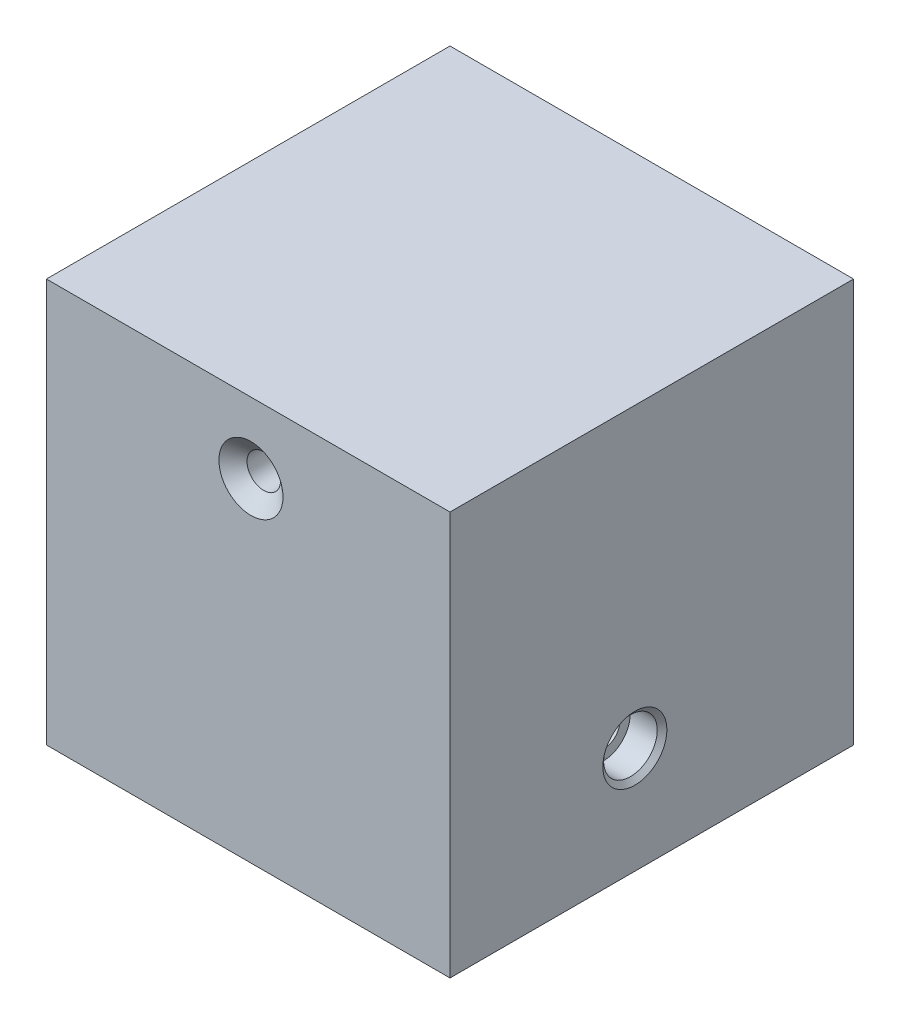
ISO-10303-21;
HEADER;
FILE_DESCRIPTION(('STEP AP214'),'2;1');
FILE_NAME('part.step','',(''),(''),'','','');
FILE_SCHEMA(('AUTOMOTIVE_DESIGN { 1 0 10303 214 1 1 1 1 }'));
ENDSEC;
DATA;
#1=APPLICATION_CONTEXT('core data for automotive mechanical design processes');
#2=APPLICATION_PROTOCOL_DEFINITION('international standard','automotive_design',2000,#1);
#3=PRODUCT_CONTEXT('',#1,'mechanical');
#4=PRODUCT('Part','Part','',(#3));
#5=PRODUCT_RELATED_PRODUCT_CATEGORY('part','',(#4));
#6=PRODUCT_DEFINITION_FORMATION('','',#4);
#7=PRODUCT_DEFINITION_CONTEXT('part definition',#1,'design');
#8=PRODUCT_DEFINITION('design','',#6,#7);
#9=PRODUCT_DEFINITION_SHAPE('','',#8);
#10=(LENGTH_UNIT() NAMED_UNIT(*) SI_UNIT(.MILLI.,.METRE.));
#11=(NAMED_UNIT(*) PLANE_ANGLE_UNIT() SI_UNIT($,.RADIAN.));
#12=(NAMED_UNIT(*) SI_UNIT($,.STERADIAN.) SOLID_ANGLE_UNIT());
#13=UNCERTAINTY_MEASURE_WITH_UNIT(LENGTH_MEASURE(1.E-05),#10,'distance_accuracy_value','');
#14=(GEOMETRIC_REPRESENTATION_CONTEXT(3) GLOBAL_UNCERTAINTY_ASSIGNED_CONTEXT((#13)) GLOBAL_UNIT_ASSIGNED_CONTEXT((#10,
#11,#12)) REPRESENTATION_CONTEXT('',''));
#15=CARTESIAN_POINT('',(0.,0.,0.));
#16=DIRECTION('',(0.,0.,1.));
#17=DIRECTION('',(1.,0.,0.));
#18=AXIS2_PLACEMENT_3D('',#15,#16,#17);
#19=CARTESIAN_POINT('',(101.6,26.8232451806077,55.0625341901142));
#20=DIRECTION('',(1.,0.,0.));
#21=DIRECTION('',(0.,0.,-1.));
#22=AXIS2_PLACEMENT_3D('',#19,#20,#21);
#23=CYLINDRICAL_SURFACE('',#22,4.21639999999999);
#24=CARTESIAN_POINT('',(93.6625,26.8232451806077,55.0625341901142));
#25=DIRECTION('',(1.,0.,0.));
#26=DIRECTION('',(0.,0.,-1.));
#27=AXIS2_PLACEMENT_3D('',#24,#25,#26);
#28=CIRCLE('',#27,4.21640000000001);
#29=CARTESIAN_POINT('',(93.6625,26.8232451806077,50.8461341901142));
#30=VERTEX_POINT('',#29);
#31=EDGE_CURVE('E361',#30,#30,#28,.T.);
#32=ORIENTED_EDGE('',*,*,#31,.T.);
#33=EDGE_LOOP('',(#32));
#34=FACE_BOUND('',#33,.T.);
#35=CARTESIAN_POINT('',(12.7,26.8232451806077,55.0625341901142));
#36=DIRECTION('',(-1.,0.,0.));
#37=DIRECTION('',(0.,0.,1.));
#38=AXIS2_PLACEMENT_3D('',#35,#36,#37);
#39=CIRCLE('',#38,4.21639999999999);
#40=CARTESIAN_POINT('',(12.7,26.8232451806077,59.2789341901142));
#41=VERTEX_POINT('',#40);
#42=EDGE_CURVE('E137',#41,#41,#39,.F.);
#43=ORIENTED_EDGE('',*,*,#42,.F.);
#44=EDGE_LOOP('',(#43));
#45=FACE_BOUND('',#44,.T.);
#46=ADVANCED_FACE('F46',(#34,#45),#23,.F.);
#47=CARTESIAN_POINT('',(0.,0.,101.6));
#48=DIRECTION('',(1.,0.,0.));
#49=DIRECTION('',(0.,0.,-1.));
#50=AXIS2_PLACEMENT_3D('',#47,#48,#49);
#51=PLANE('',#50);
#52=CARTESIAN_POINT('',(0.,26.8232451806077,55.0625341901142));
#53=DIRECTION('',(1.,0.,0.));
#54=DIRECTION('',(0.,0.,-1.));
#55=AXIS2_PLACEMENT_3D('',#52,#53,#54);
#56=CIRCLE('',#55,9.46277456392465);
#57=CARTESIAN_POINT('',(0.,26.8232451806077,45.5997596261896));
#58=VERTEX_POINT('',#57);
#59=EDGE_CURVE('E12',#58,#58,#56,.T.);
#60=ORIENTED_EDGE('',*,*,#59,.T.);
#61=EDGE_LOOP('',(#60));
#62=FACE_BOUND('',#61,.T.);
#63=DIRECTION('',(0.,-1.,0.));
#64=VECTOR('',#63,1.);
#65=CARTESIAN_POINT('',(0.,0.,0.));
#66=LINE('',#65,#64);
#67=CARTESIAN_POINT('',(0.,101.6,0.));
#68=VERTEX_POINT('',#67);
#69=CARTESIAN_POINT('',(0.,0.,0.));
#70=VERTEX_POINT('',#69);
#71=EDGE_CURVE('E120',#68,#70,#66,.T.);
#72=ORIENTED_EDGE('',*,*,#71,.T.);
#73=DIRECTION('',(0.,0.,-1.));
#74=VECTOR('',#73,1.);
#75=CARTESIAN_POINT('',(0.,0.,101.6));
#76=LINE('',#75,#74);
#77=CARTESIAN_POINT('',(0.,0.,101.6));
#78=VERTEX_POINT('',#77);
#79=EDGE_CURVE('E109',#78,#70,#76,.T.);
#80=ORIENTED_EDGE('',*,*,#79,.F.);
#81=DIRECTION('',(0.,-1.,0.));
#82=VECTOR('',#81,1.);
#83=CARTESIAN_POINT('',(0.,0.,101.6));
#84=LINE('',#83,#82);
#85=CARTESIAN_POINT('',(0.,101.6,101.6));
#86=VERTEX_POINT('',#85);
#87=EDGE_CURVE('E101',#86,#78,#84,.T.);
#88=ORIENTED_EDGE('',*,*,#87,.F.);
#89=DIRECTION('',(0.,0.,-1.));
#90=VECTOR('',#89,1.);
#91=CARTESIAN_POINT('',(0.,101.6,101.6));
#92=LINE('',#91,#90);
#93=EDGE_CURVE('E116',#86,#68,#92,.T.);
#94=ORIENTED_EDGE('',*,*,#93,.T.);
#95=EDGE_LOOP('',(#72,#80,#88,#94));
#96=FACE_BOUND('',#95,.T.);
#97=ADVANCED_FACE('F158',(#62,#96),#51,.F.);
#98=CARTESIAN_POINT('',(0.,0.,101.6));
#99=DIRECTION('',(0.,1.,0.));
#100=DIRECTION('',(0.,0.,1.));
#101=AXIS2_PLACEMENT_3D('',#98,#99,#100);
#102=PLANE('',#101);
#103=DIRECTION('',(1.,0.,0.));
#104=VECTOR('',#103,1.);
#105=CARTESIAN_POINT('',(0.,0.,0.));
#106=LINE('',#105,#104);
#107=CARTESIAN_POINT('',(101.6,0.,0.));
#108=VERTEX_POINT('',#107);
#109=EDGE_CURVE('E107',#70,#108,#106,.T.);
#110=ORIENTED_EDGE('',*,*,#109,.T.);
#111=DIRECTION('',(0.,0.,-1.));
#112=VECTOR('',#111,1.);
#113=CARTESIAN_POINT('',(101.6,0.,101.6));
#114=LINE('',#113,#112);
#115=CARTESIAN_POINT('',(101.6,0.,101.6));
#116=VERTEX_POINT('',#115);
#117=EDGE_CURVE('E105',#116,#108,#114,.T.);
#118=ORIENTED_EDGE('',*,*,#117,.F.);
#119=DIRECTION('',(1.,0.,0.));
#120=VECTOR('',#119,1.);
#121=CARTESIAN_POINT('',(0.,0.,101.6));
#122=LINE('',#121,#120);
#123=EDGE_CURVE('E96',#78,#116,#122,.T.);
#124=ORIENTED_EDGE('',*,*,#123,.F.);
#125=ORIENTED_EDGE('',*,*,#79,.T.);
#126=EDGE_LOOP('',(#110,#118,#124,#125));
#127=FACE_BOUND('',#126,.T.);
#128=ADVANCED_FACE('F106',(#127),#102,.F.);
#129=CARTESIAN_POINT('',(101.6,0.,101.6));
#130=DIRECTION('',(-1.,0.,0.));
#131=DIRECTION('',(0.,0.,1.));
#132=AXIS2_PLACEMENT_3D('',#129,#130,#131);
#133=PLANE('',#132);
#134=CARTESIAN_POINT('',(101.6,26.8232451806077,55.0625341901142));
#135=DIRECTION('',(1.,0.,0.));
#136=DIRECTION('',(0.,0.,-1.));
#137=AXIS2_PLACEMENT_3D('',#134,#135,#136);
#138=CIRCLE('',#137,8.06450000000001);
#139=CARTESIAN_POINT('',(101.6,26.8232451806077,46.9980341901142));
#140=VERTEX_POINT('',#139);
#141=EDGE_CURVE('E140',#140,#140,#138,.T.);
#142=ORIENTED_EDGE('',*,*,#141,.F.);
#143=EDGE_LOOP('',(#142));
#144=FACE_BOUND('',#143,.T.);
#145=DIRECTION('',(0.,1.,0.));
#146=VECTOR('',#145,1.);
#147=CARTESIAN_POINT('',(101.6,0.,0.));
#148=LINE('',#147,#146);
#149=CARTESIAN_POINT('',(101.6,101.6,0.));
#150=VERTEX_POINT('',#149);
#151=EDGE_CURVE('E82',#108,#150,#148,.T.);
#152=ORIENTED_EDGE('',*,*,#151,.T.);
#153=DIRECTION('',(0.,0.,-1.));
#154=VECTOR('',#153,1.);
#155=CARTESIAN_POINT('',(101.6,101.6,101.6));
#156=LINE('',#155,#154);
#157=CARTESIAN_POINT('',(101.6,101.6,101.6));
#158=VERTEX_POINT('',#157);
#159=EDGE_CURVE('E110',#158,#150,#156,.T.);
#160=ORIENTED_EDGE('',*,*,#159,.F.);
#161=DIRECTION('',(0.,1.,0.));
#162=VECTOR('',#161,1.);
#163=CARTESIAN_POINT('',(101.6,0.,101.6));
#164=LINE('',#163,#162);
#165=EDGE_CURVE('E99',#116,#158,#164,.T.);
#166=ORIENTED_EDGE('',*,*,#165,.F.);
#167=ORIENTED_EDGE('',*,*,#117,.T.);
#168=EDGE_LOOP('',(#152,#160,#166,#167));
#169=FACE_BOUND('',#168,.T.);
#170=ADVANCED_FACE('F112',(#144,#169),#133,.F.);
#171=CARTESIAN_POINT('',(0.,101.6,101.6));
#172=DIRECTION('',(0.,-1.,0.));
#173=DIRECTION('',(0.,0.,-1.));
#174=AXIS2_PLACEMENT_3D('',#171,#172,#173);
#175=PLANE('',#174);
#176=DIRECTION('',(-1.,0.,0.));
#177=VECTOR('',#176,1.);
#178=CARTESIAN_POINT('',(0.,101.6,0.));
#179=LINE('',#178,#177);
#180=EDGE_CURVE('E88',#150,#68,#179,.T.);
#181=ORIENTED_EDGE('',*,*,#180,.T.);
#182=ORIENTED_EDGE('',*,*,#93,.F.);
#183=DIRECTION('',(-1.,0.,0.));
#184=VECTOR('',#183,1.);
#185=CARTESIAN_POINT('',(0.,101.6,101.6));
#186=LINE('',#185,#184);
#187=EDGE_CURVE('E65',#158,#86,#186,.T.);
#188=ORIENTED_EDGE('',*,*,#187,.F.);
#189=ORIENTED_EDGE('',*,*,#159,.T.);
#190=EDGE_LOOP('',(#181,#182,#188,#189));
#191=FACE_BOUND('',#190,.T.);
#192=ADVANCED_FACE('F186',(#191),#175,.F.);
#193=CARTESIAN_POINT('',(0.,0.,101.6));
#194=DIRECTION('',(0.,0.,-1.));
#195=DIRECTION('',(-1.,0.,0.));
#196=AXIS2_PLACEMENT_3D('',#193,#194,#195);
#197=PLANE('',#196);
#198=CARTESIAN_POINT('',(51.4900872333897,83.8414821838995,101.6));
#199=DIRECTION('',(0.,0.,1.));
#200=DIRECTION('',(1.,0.,0.));
#201=AXIS2_PLACEMENT_3D('',#198,#199,#200);
#202=CIRCLE('',#201,8.0645);
#203=CARTESIAN_POINT('',(59.5545872333897,83.8414821838995,101.6));
#204=VERTEX_POINT('',#203);
#205=EDGE_CURVE('E372',#204,#204,#202,.T.);
#206=ORIENTED_EDGE('',*,*,#205,.F.);
#207=EDGE_LOOP('',(#206));
#208=FACE_BOUND('',#207,.T.);
#209=ORIENTED_EDGE('',*,*,#87,.T.);
#210=ORIENTED_EDGE('',*,*,#123,.T.);
#211=ORIENTED_EDGE('',*,*,#165,.T.);
#212=ORIENTED_EDGE('',*,*,#187,.T.);
#213=EDGE_LOOP('',(#209,#210,#211,#212));
#214=FACE_BOUND('',#213,.T.);
#215=ADVANCED_FACE('F97',(#208,#214),#197,.F.);
#216=CARTESIAN_POINT('',(0.,0.,0.));
#217=DIRECTION('',(0.,0.,-1.));
#218=DIRECTION('',(-1.,0.,0.));
#219=AXIS2_PLACEMENT_3D('',#216,#217,#218);
#220=PLANE('',#219);
#221=CARTESIAN_POINT('',(51.4900872333897,83.8414821838995,0.));
#222=DIRECTION('',(0.,0.,1.));
#223=DIRECTION('',(1.,0.,0.));
#224=AXIS2_PLACEMENT_3D('',#221,#222,#223);
#225=CIRCLE('',#224,8.06449999999997);
#226=CARTESIAN_POINT('',(59.5545872333896,83.8414821838995,0.));
#227=VERTEX_POINT('',#226);
#228=EDGE_CURVE('E365',#227,#227,#225,.T.);
#229=ORIENTED_EDGE('',*,*,#228,.T.);
#230=EDGE_LOOP('',(#229));
#231=FACE_BOUND('',#230,.T.);
#232=ORIENTED_EDGE('',*,*,#71,.F.);
#233=ORIENTED_EDGE('',*,*,#180,.F.);
#234=ORIENTED_EDGE('',*,*,#151,.F.);
#235=ORIENTED_EDGE('',*,*,#109,.F.);
#236=EDGE_LOOP('',(#232,#233,#234,#235));
#237=FACE_BOUND('',#236,.T.);
#238=ADVANCED_FACE('F182',(#231,#237),#220,.T.);
#239=CARTESIAN_POINT('',(51.4900872333897,83.8414821838995,3.22893929073329));
#240=DIRECTION('',(0.,0.,-1.));
#241=DIRECTION('',(-1.,0.,0.));
#242=AXIS2_PLACEMENT_3D('',#239,#240,#241);
#243=CONICAL_SURFACE('',#242,4.21639999999998,0.872664625997165);
#244=ORIENTED_EDGE('',*,*,#228,.F.);
#245=EDGE_LOOP('',(#244));
#246=FACE_BOUND('',#245,.T.);
#247=CARTESIAN_POINT('',(51.4900872333897,83.8414821838995,3.22893929073329));
#248=DIRECTION('',(0.,0.,1.));
#249=DIRECTION('',(1.,0.,0.));
#250=AXIS2_PLACEMENT_3D('',#247,#248,#249);
#251=CIRCLE('',#250,4.21639999999998);
#252=CARTESIAN_POINT('',(55.7064872333896,83.8414821838995,3.22893929073329));
#253=VERTEX_POINT('',#252);
#254=EDGE_CURVE('E124',#253,#253,#251,.T.);
#255=ORIENTED_EDGE('',*,*,#254,.T.);
#256=EDGE_LOOP('',(#255));
#257=FACE_BOUND('',#256,.T.);
#258=ADVANCED_FACE('F178',(#246,#257),#243,.F.);
#259=CARTESIAN_POINT('',(51.4900872333897,83.8414821838995,101.6));
#260=DIRECTION('',(0.,0.,1.));
#261=DIRECTION('',(1.,0.,0.));
#262=AXIS2_PLACEMENT_3D('',#259,#260,#261);
#263=CYLINDRICAL_SURFACE('',#262,4.21639999999999);
#264=ORIENTED_EDGE('',*,*,#254,.F.);
#265=EDGE_LOOP('',(#264));
#266=FACE_BOUND('',#265,.T.);
#267=CARTESIAN_POINT('',(51.4900872333897,83.8414821838995,98.3710607092667));
#268=DIRECTION('',(0.,0.,1.));
#269=DIRECTION('',(1.,0.,0.));
#270=AXIS2_PLACEMENT_3D('',#267,#268,#269);
#271=CIRCLE('',#270,4.21639999999999);
#272=CARTESIAN_POINT('',(55.7064872333897,83.8414821838995,98.3710607092667));
#273=VERTEX_POINT('',#272);
#274=EDGE_CURVE('E382',#273,#273,#271,.T.);
#275=ORIENTED_EDGE('',*,*,#274,.T.);
#276=EDGE_LOOP('',(#275));
#277=FACE_BOUND('',#276,.T.);
#278=ADVANCED_FACE('F174',(#266,#277),#263,.F.);
#279=CARTESIAN_POINT('',(51.4900872333897,83.8414821838995,101.6));
#280=DIRECTION('',(0.,0.,1.));
#281=DIRECTION('',(1.,0.,0.));
#282=AXIS2_PLACEMENT_3D('',#279,#280,#281);
#283=CONICAL_SURFACE('',#282,8.0645,0.872664625997167);
#284=ORIENTED_EDGE('',*,*,#274,.F.);
#285=EDGE_LOOP('',(#284));
#286=FACE_BOUND('',#285,.T.);
#287=ORIENTED_EDGE('',*,*,#205,.T.);
#288=EDGE_LOOP('',(#287));
#289=FACE_BOUND('',#288,.T.);
#290=ADVANCED_FACE('F171',(#286,#289),#283,.F.);
#291=CARTESIAN_POINT('',(93.6625,33.5707551806077,55.0625341901142));
#292=DIRECTION('',(-1.,0.,0.));
#293=DIRECTION('',(0.,0.,1.));
#294=AXIS2_PLACEMENT_3D('',#291,#292,#293);
#295=PLANE('',#294);
#296=ORIENTED_EDGE('',*,*,#31,.F.);
#297=EDGE_LOOP('',(#296));
#298=FACE_BOUND('',#297,.T.);
#299=CARTESIAN_POINT('',(93.6625,26.8232451806077,55.0625341901142));
#300=DIRECTION('',(1.,0.,0.));
#301=DIRECTION('',(0.,0.,-1.));
#302=AXIS2_PLACEMENT_3D('',#299,#300,#301);
#303=CIRCLE('',#302,6.74750999999999);
#304=CARTESIAN_POINT('',(93.6625,26.8232451806077,48.3150241901142));
#305=VERTEX_POINT('',#304);
#306=EDGE_CURVE('E366',#305,#305,#303,.T.);
#307=ORIENTED_EDGE('',*,*,#306,.T.);
#308=EDGE_LOOP('',(#307));
#309=FACE_BOUND('',#308,.T.);
#310=ADVANCED_FACE('F169',(#298,#309),#295,.F.);
#311=CARTESIAN_POINT('',(101.6,26.8232451806077,55.0625341901142));
#312=DIRECTION('',(1.,0.,0.));
#313=DIRECTION('',(0.,0.,-1.));
#314=AXIS2_PLACEMENT_3D('',#311,#312,#313);
#315=CYLINDRICAL_SURFACE('',#314,6.74751);
#316=ORIENTED_EDGE('',*,*,#306,.F.);
#317=EDGE_LOOP('',(#316));
#318=FACE_BOUND('',#317,.T.);
#319=CARTESIAN_POINT('',(100.494914176736,26.8232451806077,55.0625341901142));
#320=DIRECTION('',(1.,0.,0.));
#321=DIRECTION('',(0.,0.,-1.));
#322=AXIS2_PLACEMENT_3D('',#319,#320,#321);
#323=CIRCLE('',#322,6.74751);
#324=CARTESIAN_POINT('',(100.494914176736,26.8232451806077,48.3150241901142));
#325=VERTEX_POINT('',#324);
#326=EDGE_CURVE('E392',#325,#325,#323,.T.);
#327=ORIENTED_EDGE('',*,*,#326,.T.);
#328=EDGE_LOOP('',(#327));
#329=FACE_BOUND('',#328,.T.);
#330=ADVANCED_FACE('F235',(#318,#329),#315,.F.);
#331=CARTESIAN_POINT('',(101.6,26.8232451806077,55.0625341901142));
#332=DIRECTION('',(1.,0.,0.));
#333=DIRECTION('',(0.,0.,-1.));
#334=AXIS2_PLACEMENT_3D('',#331,#332,#333);
#335=CONICAL_SURFACE('',#334,8.06450000000001,0.872664625997164);
#336=ORIENTED_EDGE('',*,*,#326,.F.);
#337=EDGE_LOOP('',(#336));
#338=FACE_BOUND('',#337,.T.);
#339=ORIENTED_EDGE('',*,*,#141,.T.);
#340=EDGE_LOOP('',(#339));
#341=FACE_BOUND('',#340,.T.);
#342=ADVANCED_FACE('F242',(#338,#341),#335,.F.);
#343=CARTESIAN_POINT('',(12.7,26.8232451806077,55.0625341901142));
#344=DIRECTION('',(-1.,0.,0.));
#345=DIRECTION('',(0.,0.,1.));
#346=AXIS2_PLACEMENT_3D('',#343,#344,#345);
#347=PLANE('',#346);
#348=CARTESIAN_POINT('',(12.7,26.8232451806077,55.0625341901142));
#349=DIRECTION('',(-1.,0.,0.));
#350=DIRECTION('',(0.,0.,1.));
#351=AXIS2_PLACEMENT_3D('',#348,#349,#350);
#352=CIRCLE('',#351,6.92277456392466);
#353=CARTESIAN_POINT('',(12.7,26.8232451806077,61.9853087540389));
#354=VERTEX_POINT('',#353);
#355=EDGE_CURVE('E141',#354,#354,#352,.T.);
#356=ORIENTED_EDGE('',*,*,#355,.T.);
#357=EDGE_LOOP('',(#356));
#358=FACE_BOUND('',#357,.T.);
#359=ORIENTED_EDGE('',*,*,#42,.T.);
#360=EDGE_LOOP('',(#359));
#361=FACE_BOUND('',#360,.T.);
#362=ADVANCED_FACE('F154',(#358,#361),#347,.T.);
#363=CARTESIAN_POINT('',(12.7,26.8232451806077,55.0625341901142));
#364=DIRECTION('',(-1.,0.,0.));
#365=DIRECTION('',(0.,0.,1.));
#366=AXIS2_PLACEMENT_3D('',#363,#364,#365);
#367=CYLINDRICAL_SURFACE('',#366,6.92277456392466);
#368=CARTESIAN_POINT('',(2.53999999999997,26.8232451806077,55.0625341901142));
#369=DIRECTION('',(1.,0.,0.));
#370=DIRECTION('',(0.,0.,-1.));
#371=AXIS2_PLACEMENT_3D('',#368,#369,#370);
#372=CIRCLE('',#371,6.92277456392466);
#373=CARTESIAN_POINT('',(2.53999999999997,26.8232451806077,48.1397596261896));
#374=VERTEX_POINT('',#373);
#375=EDGE_CURVE('E57',#374,#374,#372,.F.);
#376=ORIENTED_EDGE('',*,*,#375,.T.);
#377=EDGE_LOOP('',(#376));
#378=FACE_BOUND('',#377,.T.);
#379=ORIENTED_EDGE('',*,*,#355,.F.);
#380=EDGE_LOOP('',(#379));
#381=FACE_BOUND('',#380,.T.);
#382=ADVANCED_FACE('F146',(#378,#381),#367,.F.);
#383=CARTESIAN_POINT('',(2.53999999999997,26.8232451806077,55.0625341901142));
#384=DIRECTION('',(-1.,0.,0.));
#385=DIRECTION('',(0.,0.,1.));
#386=AXIS2_PLACEMENT_3D('',#383,#384,#385);
#387=CONICAL_SURFACE('',#386,6.92277456392466,0.785398163397452);
#388=ORIENTED_EDGE('',*,*,#59,.F.);
#389=EDGE_LOOP('',(#388));
#390=FACE_BOUND('',#389,.T.);
#391=ORIENTED_EDGE('',*,*,#375,.F.);
#392=EDGE_LOOP('',(#391));
#393=FACE_BOUND('',#392,.T.);
#394=ADVANCED_FACE('F48',(#390,#393),#387,.F.);
#395=CLOSED_SHELL('',(#46,#97,#128,#170,#192,#215,#238,#258,#278,#290,#310,#330,#342,#362,#382,#394));
#396=MANIFOLD_SOLID_BREP('B2',#395);
#397=ADVANCED_BREP_SHAPE_REPRESENTATION('',(#18,#396),#14);
#398=SHAPE_DEFINITION_REPRESENTATION(#9,#397);
ENDSEC;
END-ISO-10303-21;
